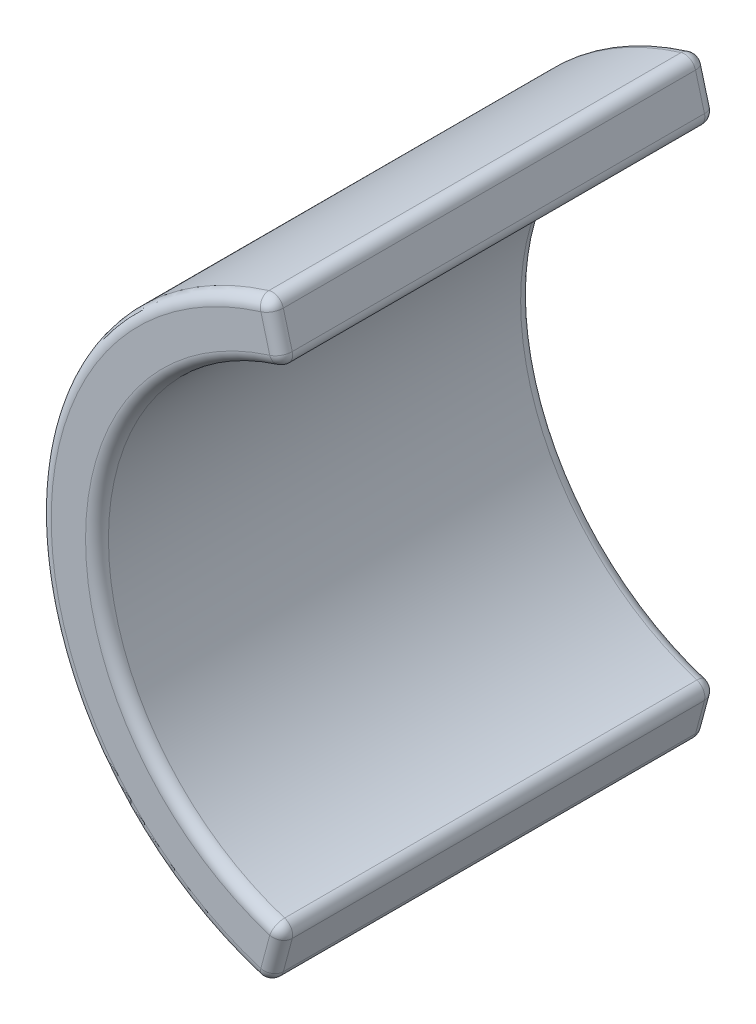
ISO-10303-21;
HEADER;
FILE_DESCRIPTION(('STEP AP214'),'2;1');
FILE_NAME('part.step','',(''),(''),'','','');
FILE_SCHEMA(('AUTOMOTIVE_DESIGN { 1 0 10303 214 1 1 1 1 }'));
ENDSEC;
DATA;
#1=APPLICATION_CONTEXT('core data for automotive mechanical design processes');
#2=APPLICATION_PROTOCOL_DEFINITION('international standard','automotive_design',2000,#1);
#3=PRODUCT_CONTEXT('',#1,'mechanical');
#4=PRODUCT('Part','Part','',(#3));
#5=PRODUCT_RELATED_PRODUCT_CATEGORY('part','',(#4));
#6=PRODUCT_DEFINITION_FORMATION('','',#4);
#7=PRODUCT_DEFINITION_CONTEXT('part definition',#1,'design');
#8=PRODUCT_DEFINITION('design','',#6,#7);
#9=PRODUCT_DEFINITION_SHAPE('','',#8);
#10=(LENGTH_UNIT() NAMED_UNIT(*) SI_UNIT(.MILLI.,.METRE.));
#11=(NAMED_UNIT(*) PLANE_ANGLE_UNIT() SI_UNIT($,.RADIAN.));
#12=(NAMED_UNIT(*) SI_UNIT($,.STERADIAN.) SOLID_ANGLE_UNIT());
#13=UNCERTAINTY_MEASURE_WITH_UNIT(LENGTH_MEASURE(1.E-05),#10,'distance_accuracy_value','');
#14=(GEOMETRIC_REPRESENTATION_CONTEXT(3) GLOBAL_UNCERTAINTY_ASSIGNED_CONTEXT((#13)) GLOBAL_UNIT_ASSIGNED_CONTEXT((#10,
#11,#12)) REPRESENTATION_CONTEXT('',''));
#15=CARTESIAN_POINT('',(0.,0.,0.));
#16=DIRECTION('',(0.,0.,1.));
#17=DIRECTION('',(1.,0.,0.));
#18=AXIS2_PLACEMENT_3D('',#15,#16,#17);
#19=CARTESIAN_POINT('',(0.,0.,0.));
#20=DIRECTION('',(0.,0.,1.));
#21=DIRECTION('',(1.,0.,0.));
#22=AXIS2_PLACEMENT_3D('',#19,#20,#21);
#23=CYLINDRICAL_SURFACE('',#22,13.5);
#24=DIRECTION('',(0.,0.,1.));
#25=VECTOR('',#24,1.);
#26=CARTESIAN_POINT('',(-3.99301020045834,12.8959633040357,0.));
#27=LINE('',#26,#25);
#28=CARTESIAN_POINT('',(-3.99301020045834,12.8959633040357,9.));
#29=VERTEX_POINT('',#28);
#30=CARTESIAN_POINT('',(-3.99301020045834,12.8959633040357,-9.));
#31=VERTEX_POINT('',#30);
#32=EDGE_CURVE('E131',#29,#31,#27,.F.);
#33=ORIENTED_EDGE('',*,*,#32,.T.);
#34=CARTESIAN_POINT('',(0.,0.,-9.));
#35=DIRECTION('',(0.,0.,1.));
#36=DIRECTION('',(1.,0.,0.));
#37=AXIS2_PLACEMENT_3D('',#34,#35,#36);
#38=CIRCLE('',#37,13.5);
#39=CARTESIAN_POINT('',(-3.99301020045834,-12.8959633040357,-9.));
#40=VERTEX_POINT('',#39);
#41=EDGE_CURVE('E127',#31,#40,#38,.T.);
#42=ORIENTED_EDGE('',*,*,#41,.T.);
#43=DIRECTION('',(0.,0.,1.));
#44=VECTOR('',#43,1.);
#45=CARTESIAN_POINT('',(-3.99301020045834,-12.8959633040357,0.));
#46=LINE('',#45,#44);
#47=CARTESIAN_POINT('',(-3.99301020045834,-12.8959633040357,9.));
#48=VERTEX_POINT('',#47);
#49=EDGE_CURVE('E122',#40,#48,#46,.T.);
#50=ORIENTED_EDGE('',*,*,#49,.T.);
#51=CARTESIAN_POINT('',(0.,0.,9.));
#52=DIRECTION('',(0.,0.,-1.));
#53=DIRECTION('',(-1.,0.,0.));
#54=AXIS2_PLACEMENT_3D('',#51,#52,#53);
#55=CIRCLE('',#54,13.5);
#56=EDGE_CURVE('E124',#48,#29,#55,.T.);
#57=ORIENTED_EDGE('',*,*,#56,.T.);
#58=EDGE_LOOP('',(#33,#42,#50,#57));
#59=FACE_BOUND('',#58,.T.);
#60=ADVANCED_FACE('F30',(#59),#23,.T.);
#61=CARTESIAN_POINT('',(-3.49405710888399,13.0399986549024,9.5));
#62=DIRECTION('',(0.,0.,-1.));
#63=DIRECTION('',(-1.,0.,0.));
#64=AXIS2_PLACEMENT_3D('',#61,#62,#63);
#65=PLANE('',#64);
#66=CARTESIAN_POINT('',(0.,0.,9.5));
#67=DIRECTION('',(0.,0.,-1.));
#68=DIRECTION('',(-1.,0.,0.));
#69=AXIS2_PLACEMENT_3D('',#66,#67,#68);
#70=CIRCLE('',#69,13.);
#71=CARTESIAN_POINT('',(-3.8451209337747,12.4183350335159,9.5));
#72=VERTEX_POINT('',#71);
#73=CARTESIAN_POINT('',(-3.8451209337747,-12.4183350335159,9.5));
#74=VERTEX_POINT('',#73);
#75=EDGE_CURVE('E39',#72,#74,#70,.F.);
#76=ORIENTED_EDGE('',*,*,#75,.T.);
#77=DIRECTION('',(0.258819045102518,0.965925826289069,0.));
#78=VECTOR('',#77,1.);
#79=CARTESIAN_POINT('',(2.54297930542262,11.4223796230117,9.5));
#80=LINE('',#79,#78);
#81=CARTESIAN_POINT('',(-3.45656735056167,-10.9682333195019,9.5));
#82=VERTEX_POINT('',#81);
#83=EDGE_CURVE('E11',#74,#82,#80,.T.);
#84=ORIENTED_EDGE('',*,*,#83,.T.);
#85=CARTESIAN_POINT('',(0.,0.,9.5));
#86=DIRECTION('',(0.,0.,-1.));
#87=DIRECTION('',(-1.,0.,0.));
#88=AXIS2_PLACEMENT_3D('',#85,#86,#87);
#89=CIRCLE('',#88,11.5);
#90=CARTESIAN_POINT('',(-3.45656735056167,10.9682333195019,9.5));
#91=VERTEX_POINT('',#90);
#92=EDGE_CURVE('E231',#82,#91,#89,.T.);
#93=ORIENTED_EDGE('',*,*,#92,.T.);
#94=DIRECTION('',(0.258819045102518,-0.965925826289069,0.));
#95=VECTOR('',#94,1.);
#96=CARTESIAN_POINT('',(-3.97702002202853,12.9105891323512,9.5));
#97=LINE('',#96,#95);
#98=EDGE_CURVE('E229',#91,#72,#97,.F.);
#99=ORIENTED_EDGE('',*,*,#98,.T.);
#100=EDGE_LOOP('',(#76,#84,#93,#99));
#101=FACE_BOUND('',#100,.T.);
#102=ADVANCED_FACE('F322',(#101),#65,.F.);
#103=CARTESIAN_POINT('',(0.,0.,0.));
#104=DIRECTION('',(0.,0.,1.));
#105=DIRECTION('',(1.,0.,0.));
#106=AXIS2_PLACEMENT_3D('',#103,#104,#105);
#107=CYLINDRICAL_SURFACE('',#106,11.);
#108=CARTESIAN_POINT('',(0.,0.,-9.));
#109=DIRECTION('',(0.,0.,1.));
#110=DIRECTION('',(1.,0.,0.));
#111=AXIS2_PLACEMENT_3D('',#108,#109,#110);
#112=CIRCLE('',#111,11.);
#113=CARTESIAN_POINT('',(-3.30628181358072,-10.4913536099583,-9.));
#114=VERTEX_POINT('',#113);
#115=CARTESIAN_POINT('',(-3.30628181358072,10.4913536099583,-9.));
#116=VERTEX_POINT('',#115);
#117=EDGE_CURVE('E214',#114,#116,#112,.F.);
#118=ORIENTED_EDGE('',*,*,#117,.T.);
#119=DIRECTION('',(0.,0.,1.));
#120=VECTOR('',#119,1.);
#121=CARTESIAN_POINT('',(-3.30628181358072,10.4913536099583,0.));
#122=LINE('',#121,#120);
#123=CARTESIAN_POINT('',(-3.30628181358072,10.4913536099583,9.));
#124=VERTEX_POINT('',#123);
#125=EDGE_CURVE('E211',#116,#124,#122,.T.);
#126=ORIENTED_EDGE('',*,*,#125,.T.);
#127=CARTESIAN_POINT('',(0.,0.,9.));
#128=DIRECTION('',(0.,0.,-1.));
#129=DIRECTION('',(-1.,0.,0.));
#130=AXIS2_PLACEMENT_3D('',#127,#128,#129);
#131=CIRCLE('',#130,11.);
#132=CARTESIAN_POINT('',(-3.30628181358072,-10.4913536099583,9.));
#133=VERTEX_POINT('',#132);
#134=EDGE_CURVE('E204',#124,#133,#131,.F.);
#135=ORIENTED_EDGE('',*,*,#134,.T.);
#136=DIRECTION('',(0.,0.,1.));
#137=VECTOR('',#136,1.);
#138=CARTESIAN_POINT('',(-3.30628181358072,-10.4913536099583,0.));
#139=LINE('',#138,#137);
#140=EDGE_CURVE('E207',#133,#114,#139,.F.);
#141=ORIENTED_EDGE('',*,*,#140,.T.);
#142=EDGE_LOOP('',(#118,#126,#135,#141));
#143=FACE_BOUND('',#142,.T.);
#144=ADVANCED_FACE('F212',(#143),#107,.F.);
#145=CARTESIAN_POINT('',(-3.49405710888399,13.0399986549024,-9.5));
#146=DIRECTION('',(0.,0.,1.));
#147=DIRECTION('',(1.,0.,0.));
#148=AXIS2_PLACEMENT_3D('',#145,#146,#147);
#149=PLANE('',#148);
#150=CARTESIAN_POINT('',(0.,0.,-9.5));
#151=DIRECTION('',(0.,0.,1.));
#152=DIRECTION('',(1.,0.,0.));
#153=AXIS2_PLACEMENT_3D('',#150,#151,#152);
#154=CIRCLE('',#153,11.5);
#155=CARTESIAN_POINT('',(-3.45656735056167,10.9682333195019,-9.5));
#156=VERTEX_POINT('',#155);
#157=CARTESIAN_POINT('',(-3.45656735056167,-10.9682333195019,-9.5));
#158=VERTEX_POINT('',#157);
#159=EDGE_CURVE('E259',#156,#158,#154,.T.);
#160=ORIENTED_EDGE('',*,*,#159,.T.);
#161=DIRECTION('',(-0.258819045102518,-0.965925826289069,0.));
#162=VECTOR('',#161,1.);
#163=CARTESIAN_POINT('',(2.54297930542262,11.4223796230117,-9.5));
#164=LINE('',#163,#162);
#165=CARTESIAN_POINT('',(-3.8451209337747,-12.4183350335159,-9.5));
#166=VERTEX_POINT('',#165);
#167=EDGE_CURVE('E265',#158,#166,#164,.T.);
#168=ORIENTED_EDGE('',*,*,#167,.T.);
#169=CARTESIAN_POINT('',(0.,0.,-9.5));
#170=DIRECTION('',(0.,0.,1.));
#171=DIRECTION('',(1.,0.,0.));
#172=AXIS2_PLACEMENT_3D('',#169,#170,#171);
#173=CIRCLE('',#172,13.);
#174=CARTESIAN_POINT('',(-3.8451209337747,12.4183350335159,-9.5));
#175=VERTEX_POINT('',#174);
#176=EDGE_CURVE('E262',#166,#175,#173,.F.);
#177=ORIENTED_EDGE('',*,*,#176,.T.);
#178=DIRECTION('',(-0.258819045102518,0.965925826289069,0.));
#179=VECTOR('',#178,1.);
#180=CARTESIAN_POINT('',(-3.32997240927223,10.4957745666285,-9.5));
#181=LINE('',#180,#179);
#182=EDGE_CURVE('E253',#175,#156,#181,.F.);
#183=ORIENTED_EDGE('',*,*,#182,.T.);
#184=EDGE_LOOP('',(#160,#168,#177,#183));
#185=FACE_BOUND('',#184,.T.);
#186=ADVANCED_FACE('F263',(#185),#149,.F.);
#187=CARTESIAN_POINT('',(-3.49405710888399,13.0399986549024,9.5));
#188=DIRECTION('',(0.965925826289069,0.258819045102518,0.));
#189=DIRECTION('',(0.,0.,1.));
#190=AXIS2_PLACEMENT_3D('',#187,#188,#189);
#191=PLANE('',#190);
#192=DIRECTION('',(0.,0.,-1.));
#193=VECTOR('',#192,1.);
#194=CARTESIAN_POINT('',(-2.97360443741713,11.0976428420531,-9.5));
#195=LINE('',#194,#193);
#196=CARTESIAN_POINT('',(-2.97360443741713,11.0976428420531,9.));
#197=VERTEX_POINT('',#196);
#198=CARTESIAN_POINT('',(-2.97360443741713,11.0976428420531,-9.));
#199=VERTEX_POINT('',#198);
#200=EDGE_CURVE('E277',#197,#199,#195,.T.);
#201=ORIENTED_EDGE('',*,*,#200,.T.);
#202=DIRECTION('',(-0.258819045102518,0.965925826289069,0.));
#203=VECTOR('',#202,1.);
#204=CARTESIAN_POINT('',(-3.49405710888399,13.0399986549024,-9.));
#205=LINE('',#204,#203);
#206=CARTESIAN_POINT('',(-3.36215802063016,12.5477445560671,-9.));
#207=VERTEX_POINT('',#206);
#208=EDGE_CURVE('E208',#199,#207,#205,.T.);
#209=ORIENTED_EDGE('',*,*,#208,.T.);
#210=DIRECTION('',(0.,0.,-1.));
#211=VECTOR('',#210,1.);
#212=CARTESIAN_POINT('',(-3.36215802063016,12.5477445560671,9.5));
#213=LINE('',#212,#211);
#214=CARTESIAN_POINT('',(-3.36215802063016,12.5477445560671,9.));
#215=VERTEX_POINT('',#214);
#216=EDGE_CURVE('E275',#207,#215,#213,.F.);
#217=ORIENTED_EDGE('',*,*,#216,.T.);
#218=DIRECTION('',(0.258819045102518,-0.965925826289069,0.));
#219=VECTOR('',#218,1.);
#220=CARTESIAN_POINT('',(-2.8470094961277,10.6251840891798,9.));
#221=LINE('',#220,#219);
#222=EDGE_CURVE('E270',#215,#197,#221,.T.);
#223=ORIENTED_EDGE('',*,*,#222,.T.);
#224=EDGE_LOOP('',(#201,#209,#217,#223));
#225=FACE_BOUND('',#224,.T.);
#226=ADVANCED_FACE('F305',(#225),#191,.T.);
#227=CARTESIAN_POINT('',(-3.49405710888399,-13.0399986549024,9.5));
#228=DIRECTION('',(-0.965925826289069,0.258819045102518,0.));
#229=DIRECTION('',(0.,0.,1.));
#230=AXIS2_PLACEMENT_3D('',#227,#228,#229);
#231=PLANE('',#230);
#232=DIRECTION('',(0.,0.,1.));
#233=VECTOR('',#232,1.);
#234=CARTESIAN_POINT('',(-3.36215802063016,-12.5477445560671,9.5));
#235=LINE('',#234,#233);
#236=CARTESIAN_POINT('',(-3.36215802063016,-12.5477445560671,9.));
#237=VERTEX_POINT('',#236);
#238=CARTESIAN_POINT('',(-3.36215802063016,-12.5477445560671,-9.));
#239=VERTEX_POINT('',#238);
#240=EDGE_CURVE('E147',#237,#239,#235,.F.);
#241=ORIENTED_EDGE('',*,*,#240,.T.);
#242=DIRECTION('',(-0.258819045102518,-0.965925826289069,0.));
#243=VECTOR('',#242,1.);
#244=CARTESIAN_POINT('',(-3.49405710888399,-13.0399986549024,-9.));
#245=LINE('',#244,#243);
#246=CARTESIAN_POINT('',(-2.97360443741713,-11.0976428420531,-9.));
#247=VERTEX_POINT('',#246);
#248=EDGE_CURVE('E227',#239,#247,#245,.F.);
#249=ORIENTED_EDGE('',*,*,#248,.T.);
#250=DIRECTION('',(0.,0.,1.));
#251=VECTOR('',#250,1.);
#252=CARTESIAN_POINT('',(-2.97360443741713,-11.0976428420531,9.5));
#253=LINE('',#252,#251);
#254=CARTESIAN_POINT('',(-2.97360443741713,-11.0976428420531,9.));
#255=VERTEX_POINT('',#254);
#256=EDGE_CURVE('E220',#247,#255,#253,.T.);
#257=ORIENTED_EDGE('',*,*,#256,.T.);
#258=DIRECTION('',(0.258819045102518,0.965925826289069,0.));
#259=VECTOR('',#258,1.);
#260=CARTESIAN_POINT('',(-3.49405710888399,-13.0399986549024,9.));
#261=LINE('',#260,#259);
#262=EDGE_CURVE('E218',#255,#237,#261,.F.);
#263=ORIENTED_EDGE('',*,*,#262,.T.);
#264=EDGE_LOOP('',(#241,#249,#257,#263));
#265=FACE_BOUND('',#264,.T.);
#266=ADVANCED_FACE('F333',(#265),#231,.F.);
#267=CARTESIAN_POINT('',(0.,0.,9.));
#268=DIRECTION('',(0.,0.,-1.));
#269=DIRECTION('',(-1.,0.,0.));
#270=AXIS2_PLACEMENT_3D('',#267,#268,#269);
#271=TOROIDAL_SURFACE('',#270,11.5,0.5);
#272=CARTESIAN_POINT('',(-3.45656735056167,10.9682333195019,9.));
#273=DIRECTION('',(0.95375941908712,0.300571073961883,0.));
#274=DIRECTION('',(-0.300571073961883,0.95375941908712,0.));
#275=AXIS2_PLACEMENT_3D('',#272,#273,#274);
#276=CIRCLE('',#275,0.5);
#277=EDGE_CURVE('E34',#91,#124,#276,.T.);
#278=ORIENTED_EDGE('',*,*,#277,.F.);
#279=ORIENTED_EDGE('',*,*,#92,.F.);
#280=CARTESIAN_POINT('',(-3.45656735056167,-10.9682333195019,9.));
#281=DIRECTION('',(0.95375941908712,-0.300571073961883,0.));
#282=DIRECTION('',(0.300571073961883,0.95375941908712,0.));
#283=AXIS2_PLACEMENT_3D('',#280,#281,#282);
#284=CIRCLE('',#283,0.5);
#285=EDGE_CURVE('E188',#133,#82,#284,.T.);
#286=ORIENTED_EDGE('',*,*,#285,.F.);
#287=ORIENTED_EDGE('',*,*,#134,.F.);
#288=EDGE_LOOP('',(#278,#279,#286,#287));
#289=FACE_BOUND('',#288,.T.);
#290=ADVANCED_FACE('F32',(#289),#271,.T.);
#291=CARTESIAN_POINT('',(-3.45656735056167,10.9682333195019,9.));
#292=DIRECTION('',(0.,0.,1.));
#293=DIRECTION('',(1.,0.,0.));
#294=AXIS2_PLACEMENT_3D('',#291,#292,#293);
#295=SPHERICAL_SURFACE('',#294,0.5);
#296=CARTESIAN_POINT('',(-3.45656735056167,10.9682333195019,9.));
#297=DIRECTION('',(0.258819045102519,-0.965925826289069,0.));
#298=DIRECTION('',(0.965925826289069,0.258819045102519,0.));
#299=AXIS2_PLACEMENT_3D('',#296,#297,#298);
#300=CIRCLE('',#299,0.5);
#301=EDGE_CURVE('E184',#91,#197,#300,.F.);
#302=ORIENTED_EDGE('',*,*,#301,.F.);
#303=ORIENTED_EDGE('',*,*,#277,.T.);
#304=CARTESIAN_POINT('',(-3.45656735056167,10.9682333195019,9.));
#305=DIRECTION('',(0.,0.,1.));
#306=DIRECTION('',(1.,0.,0.));
#307=AXIS2_PLACEMENT_3D('',#304,#305,#306);
#308=CIRCLE('',#307,0.5);
#309=EDGE_CURVE('E187',#197,#124,#308,.F.);
#310=ORIENTED_EDGE('',*,*,#309,.F.);
#311=EDGE_LOOP('',(#302,#303,#310));
#312=FACE_BOUND('',#311,.T.);
#313=ADVANCED_FACE('F200',(#312),#295,.T.);
#314=CARTESIAN_POINT('',(-3.45656735056167,-10.9682333195019,9.));
#315=DIRECTION('',(0.,0.,1.));
#316=DIRECTION('',(1.,0.,0.));
#317=AXIS2_PLACEMENT_3D('',#314,#315,#316);
#318=SPHERICAL_SURFACE('',#317,0.5);
#319=CARTESIAN_POINT('',(-3.45656735056167,-10.9682333195019,9.));
#320=DIRECTION('',(0.,0.,1.));
#321=DIRECTION('',(1.,0.,0.));
#322=AXIS2_PLACEMENT_3D('',#319,#320,#321);
#323=CIRCLE('',#322,0.5);
#324=EDGE_CURVE('E178',#133,#255,#323,.F.);
#325=ORIENTED_EDGE('',*,*,#324,.F.);
#326=ORIENTED_EDGE('',*,*,#285,.T.);
#327=CARTESIAN_POINT('',(-3.45656735056167,-10.9682333195019,9.));
#328=DIRECTION('',(0.258819045102516,0.96592582628907,0.));
#329=DIRECTION('',(-0.96592582628907,0.258819045102516,0.));
#330=AXIS2_PLACEMENT_3D('',#327,#328,#329);
#331=CIRCLE('',#330,0.5);
#332=EDGE_CURVE('E181',#255,#82,#331,.F.);
#333=ORIENTED_EDGE('',*,*,#332,.F.);
#334=EDGE_LOOP('',(#325,#326,#333));
#335=FACE_BOUND('',#334,.T.);
#336=ADVANCED_FACE('F458',(#335),#318,.T.);
#337=CARTESIAN_POINT('',(-3.45656735056167,10.9682333195019,0.));
#338=DIRECTION('',(0.,0.,1.));
#339=DIRECTION('',(1.,0.,0.));
#340=AXIS2_PLACEMENT_3D('',#337,#338,#339);
#341=CYLINDRICAL_SURFACE('',#340,0.5);
#342=ORIENTED_EDGE('',*,*,#309,.T.);
#343=ORIENTED_EDGE('',*,*,#125,.F.);
#344=CARTESIAN_POINT('',(-3.45656735056167,10.9682333195019,-9.));
#345=DIRECTION('',(0.,0.,-1.));
#346=DIRECTION('',(-1.,0.,0.));
#347=AXIS2_PLACEMENT_3D('',#344,#345,#346);
#348=CIRCLE('',#347,0.5);
#349=EDGE_CURVE('E172',#199,#116,#348,.T.);
#350=ORIENTED_EDGE('',*,*,#349,.F.);
#351=ORIENTED_EDGE('',*,*,#200,.F.);
#352=EDGE_LOOP('',(#342,#343,#350,#351));
#353=FACE_BOUND('',#352,.T.);
#354=ADVANCED_FACE('F450',(#353),#341,.T.);
#355=CARTESIAN_POINT('',(-3.97702002202853,12.9105891323512,9.));
#356=DIRECTION('',(-0.258819045102518,0.965925826289069,0.));
#357=DIRECTION('',(-0.965925826289069,-0.258819045102518,0.));
#358=AXIS2_PLACEMENT_3D('',#355,#356,#357);
#359=CYLINDRICAL_SURFACE('',#358,0.5);
#360=ORIENTED_EDGE('',*,*,#301,.T.);
#361=ORIENTED_EDGE('',*,*,#222,.F.);
#362=CARTESIAN_POINT('',(-3.8451209337747,12.4183350335159,9.));
#363=DIRECTION('',(-0.258819045102519,0.965925826289069,0.));
#364=DIRECTION('',(-0.965925826289069,-0.258819045102519,0.));
#365=AXIS2_PLACEMENT_3D('',#362,#363,#364);
#366=CIRCLE('',#365,0.5);
#367=EDGE_CURVE('E169',#72,#215,#366,.T.);
#368=ORIENTED_EDGE('',*,*,#367,.F.);
#369=ORIENTED_EDGE('',*,*,#98,.F.);
#370=EDGE_LOOP('',(#360,#361,#368,#369));
#371=FACE_BOUND('',#370,.T.);
#372=ADVANCED_FACE('F308',(#371),#359,.T.);
#373=CARTESIAN_POINT('',(0.,0.,9.));
#374=DIRECTION('',(0.,0.,-1.));
#375=DIRECTION('',(-1.,0.,0.));
#376=AXIS2_PLACEMENT_3D('',#373,#374,#375);
#377=TOROIDAL_SURFACE('',#376,13.,0.5);
#378=CARTESIAN_POINT('',(-3.8451209337747,-12.4183350335159,9.));
#379=DIRECTION('',(0.955256541039682,-0.295778533367284,0.));
#380=DIRECTION('',(0.295778533367284,0.955256541039682,0.));
#381=AXIS2_PLACEMENT_3D('',#378,#379,#380);
#382=CIRCLE('',#381,0.5);
#383=EDGE_CURVE('E136',#74,#48,#382,.T.);
#384=ORIENTED_EDGE('',*,*,#383,.F.);
#385=ORIENTED_EDGE('',*,*,#75,.F.);
#386=CARTESIAN_POINT('',(-3.8451209337747,12.4183350335159,9.));
#387=DIRECTION('',(0.955256541039682,0.295778533367284,0.));
#388=DIRECTION('',(-0.295778533367284,0.955256541039682,0.));
#389=AXIS2_PLACEMENT_3D('',#386,#387,#388);
#390=CIRCLE('',#389,0.5);
#391=EDGE_CURVE('E138',#29,#72,#390,.T.);
#392=ORIENTED_EDGE('',*,*,#391,.F.);
#393=ORIENTED_EDGE('',*,*,#56,.F.);
#394=EDGE_LOOP('',(#384,#385,#392,#393));
#395=FACE_BOUND('',#394,.T.);
#396=ADVANCED_FACE('F134',(#395),#377,.T.);
#397=CARTESIAN_POINT('',(2.54297930542262,11.4223796230117,9.));
#398=DIRECTION('',(0.258819045102518,0.965925826289069,0.));
#399=DIRECTION('',(-0.965925826289069,0.258819045102518,0.));
#400=AXIS2_PLACEMENT_3D('',#397,#398,#399);
#401=CYLINDRICAL_SURFACE('',#400,0.5);
#402=ORIENTED_EDGE('',*,*,#332,.T.);
#403=ORIENTED_EDGE('',*,*,#83,.F.);
#404=CARTESIAN_POINT('',(-3.8451209337747,-12.4183350335159,9.));
#405=DIRECTION('',(-0.258819045102519,-0.965925826289069,0.));
#406=DIRECTION('',(0.965925826289069,-0.258819045102519,0.));
#407=AXIS2_PLACEMENT_3D('',#404,#405,#406);
#408=CIRCLE('',#407,0.5);
#409=EDGE_CURVE('E47',#237,#74,#408,.T.);
#410=ORIENTED_EDGE('',*,*,#409,.F.);
#411=ORIENTED_EDGE('',*,*,#262,.F.);
#412=EDGE_LOOP('',(#402,#403,#410,#411));
#413=FACE_BOUND('',#412,.T.);
#414=ADVANCED_FACE('F427',(#413),#401,.T.);
#415=CARTESIAN_POINT('',(-3.45656735056167,-10.9682333195019,0.));
#416=DIRECTION('',(0.,0.,1.));
#417=DIRECTION('',(1.,0.,0.));
#418=AXIS2_PLACEMENT_3D('',#415,#416,#417);
#419=CYLINDRICAL_SURFACE('',#418,0.5);
#420=ORIENTED_EDGE('',*,*,#324,.T.);
#421=ORIENTED_EDGE('',*,*,#256,.F.);
#422=CARTESIAN_POINT('',(-3.45656735056167,-10.9682333195019,-9.));
#423=DIRECTION('',(0.,0.,-1.));
#424=DIRECTION('',(-1.,0.,0.));
#425=AXIS2_PLACEMENT_3D('',#422,#423,#424);
#426=CIRCLE('',#425,0.5);
#427=EDGE_CURVE('E164',#114,#247,#426,.T.);
#428=ORIENTED_EDGE('',*,*,#427,.F.);
#429=ORIENTED_EDGE('',*,*,#140,.F.);
#430=EDGE_LOOP('',(#420,#421,#428,#429));
#431=FACE_BOUND('',#430,.T.);
#432=ADVANCED_FACE('F288',(#431),#419,.T.);
#433=CARTESIAN_POINT('',(0.,0.,-9.));
#434=DIRECTION('',(0.,0.,1.));
#435=DIRECTION('',(1.,0.,0.));
#436=AXIS2_PLACEMENT_3D('',#433,#434,#435);
#437=TOROIDAL_SURFACE('',#436,11.5,0.5);
#438=CARTESIAN_POINT('',(-3.45656735056167,10.9682333195019,-9.));
#439=DIRECTION('',(0.95375941908712,0.300571073961883,0.));
#440=DIRECTION('',(-0.300571073961883,0.95375941908712,0.));
#441=AXIS2_PLACEMENT_3D('',#438,#439,#440);
#442=CIRCLE('',#441,0.5);
#443=EDGE_CURVE('E175',#116,#156,#442,.T.);
#444=ORIENTED_EDGE('',*,*,#443,.F.);
#445=ORIENTED_EDGE('',*,*,#117,.F.);
#446=CARTESIAN_POINT('',(-3.45656735056167,-10.9682333195019,-9.));
#447=DIRECTION('',(0.95375941908712,-0.300571073961882,0.));
#448=DIRECTION('',(0.300571073961882,0.95375941908712,0.));
#449=AXIS2_PLACEMENT_3D('',#446,#447,#448);
#450=CIRCLE('',#449,0.5);
#451=EDGE_CURVE('E161',#158,#114,#450,.T.);
#452=ORIENTED_EDGE('',*,*,#451,.F.);
#453=ORIENTED_EDGE('',*,*,#159,.F.);
#454=EDGE_LOOP('',(#444,#445,#452,#453));
#455=FACE_BOUND('',#454,.T.);
#456=ADVANCED_FACE('F285',(#455),#437,.T.);
#457=CARTESIAN_POINT('',(-3.45656735056167,10.9682333195019,-9.));
#458=DIRECTION('',(0.,0.,1.));
#459=DIRECTION('',(1.,0.,0.));
#460=AXIS2_PLACEMENT_3D('',#457,#458,#459);
#461=SPHERICAL_SURFACE('',#460,0.5);
#462=ORIENTED_EDGE('',*,*,#349,.T.);
#463=ORIENTED_EDGE('',*,*,#443,.T.);
#464=CARTESIAN_POINT('',(-3.45656735056167,10.9682333195019,-9.));
#465=DIRECTION('',(0.258819045102519,-0.965925826289069,0.));
#466=DIRECTION('',(0.965925826289069,0.258819045102519,0.));
#467=AXIS2_PLACEMENT_3D('',#464,#465,#466);
#468=CIRCLE('',#467,0.5);
#469=EDGE_CURVE('E152',#199,#156,#468,.F.);
#470=ORIENTED_EDGE('',*,*,#469,.F.);
#471=EDGE_LOOP('',(#462,#463,#470));
#472=FACE_BOUND('',#471,.T.);
#473=ADVANCED_FACE('F312',(#472),#461,.T.);
#474=CARTESIAN_POINT('',(-3.8451209337747,12.4183350335159,9.));
#475=DIRECTION('',(0.,0.,1.));
#476=DIRECTION('',(1.,0.,0.));
#477=AXIS2_PLACEMENT_3D('',#474,#475,#476);
#478=SPHERICAL_SURFACE('',#477,0.5);
#479=ORIENTED_EDGE('',*,*,#391,.T.);
#480=ORIENTED_EDGE('',*,*,#367,.T.);
#481=CARTESIAN_POINT('',(-3.8451209337747,12.4183350335159,9.));
#482=DIRECTION('',(0.,0.,1.));
#483=DIRECTION('',(1.,0.,0.));
#484=AXIS2_PLACEMENT_3D('',#481,#482,#483);
#485=CIRCLE('',#484,0.5);
#486=EDGE_CURVE('E148',#29,#215,#485,.F.);
#487=ORIENTED_EDGE('',*,*,#486,.F.);
#488=EDGE_LOOP('',(#479,#480,#487));
#489=FACE_BOUND('',#488,.T.);
#490=ADVANCED_FACE('F310',(#489),#478,.T.);
#491=CARTESIAN_POINT('',(-3.8451209337747,-12.4183350335159,9.));
#492=DIRECTION('',(0.,0.,1.));
#493=DIRECTION('',(1.,0.,0.));
#494=AXIS2_PLACEMENT_3D('',#491,#492,#493);
#495=SPHERICAL_SURFACE('',#494,0.5);
#496=ORIENTED_EDGE('',*,*,#409,.T.);
#497=ORIENTED_EDGE('',*,*,#383,.T.);
#498=CARTESIAN_POINT('',(-3.8451209337747,-12.4183350335159,9.));
#499=DIRECTION('',(0.,0.,1.));
#500=DIRECTION('',(1.,0.,0.));
#501=AXIS2_PLACEMENT_3D('',#498,#499,#500);
#502=CIRCLE('',#501,0.5);
#503=EDGE_CURVE('E142',#237,#48,#502,.F.);
#504=ORIENTED_EDGE('',*,*,#503,.F.);
#505=EDGE_LOOP('',(#496,#497,#504));
#506=FACE_BOUND('',#505,.T.);
#507=ADVANCED_FACE('F141',(#506),#495,.T.);
#508=CARTESIAN_POINT('',(-3.45656735056167,-10.9682333195019,-9.));
#509=DIRECTION('',(0.,0.,1.));
#510=DIRECTION('',(1.,0.,0.));
#511=AXIS2_PLACEMENT_3D('',#508,#509,#510);
#512=SPHERICAL_SURFACE('',#511,0.5);
#513=ORIENTED_EDGE('',*,*,#451,.T.);
#514=ORIENTED_EDGE('',*,*,#427,.T.);
#515=CARTESIAN_POINT('',(-3.45656735056167,-10.9682333195019,-9.));
#516=DIRECTION('',(0.258819045102519,0.965925826289069,0.));
#517=DIRECTION('',(-0.965925826289069,0.258819045102519,0.));
#518=AXIS2_PLACEMENT_3D('',#515,#516,#517);
#519=CIRCLE('',#518,0.5);
#520=EDGE_CURVE('E149',#158,#247,#519,.F.);
#521=ORIENTED_EDGE('',*,*,#520,.F.);
#522=EDGE_LOOP('',(#513,#514,#521));
#523=FACE_BOUND('',#522,.T.);
#524=ADVANCED_FACE('F290',(#523),#512,.T.);
#525=CARTESIAN_POINT('',(-3.97702002202853,12.9105891323512,-9.));
#526=DIRECTION('',(0.258819045102518,-0.965925826289069,0.));
#527=DIRECTION('',(0.965925826289069,0.258819045102518,0.));
#528=AXIS2_PLACEMENT_3D('',#525,#526,#527);
#529=CYLINDRICAL_SURFACE('',#528,0.5);
#530=ORIENTED_EDGE('',*,*,#469,.T.);
#531=ORIENTED_EDGE('',*,*,#182,.F.);
#532=CARTESIAN_POINT('',(-3.8451209337747,12.4183350335159,-9.));
#533=DIRECTION('',(-0.258819045102519,0.965925826289069,0.));
#534=DIRECTION('',(-0.965925826289069,-0.258819045102519,0.));
#535=AXIS2_PLACEMENT_3D('',#532,#533,#534);
#536=CIRCLE('',#535,0.5);
#537=EDGE_CURVE('E155',#207,#175,#536,.T.);
#538=ORIENTED_EDGE('',*,*,#537,.F.);
#539=ORIENTED_EDGE('',*,*,#208,.F.);
#540=EDGE_LOOP('',(#530,#531,#538,#539));
#541=FACE_BOUND('',#540,.T.);
#542=ADVANCED_FACE('F255',(#541),#529,.T.);
#543=CARTESIAN_POINT('',(-3.8451209337747,12.4183350335159,0.));
#544=DIRECTION('',(0.,0.,1.));
#545=DIRECTION('',(1.,0.,0.));
#546=AXIS2_PLACEMENT_3D('',#543,#544,#545);
#547=CYLINDRICAL_SURFACE('',#546,0.5);
#548=ORIENTED_EDGE('',*,*,#486,.T.);
#549=ORIENTED_EDGE('',*,*,#216,.F.);
#550=CARTESIAN_POINT('',(-3.8451209337747,12.4183350335159,-9.));
#551=DIRECTION('',(0.,0.,-1.));
#552=DIRECTION('',(-1.,0.,0.));
#553=AXIS2_PLACEMENT_3D('',#550,#551,#552);
#554=CIRCLE('',#553,0.5);
#555=EDGE_CURVE('E243',#31,#207,#554,.T.);
#556=ORIENTED_EDGE('',*,*,#555,.F.);
#557=ORIENTED_EDGE('',*,*,#32,.F.);
#558=EDGE_LOOP('',(#548,#549,#556,#557));
#559=FACE_BOUND('',#558,.T.);
#560=ADVANCED_FACE('F302',(#559),#547,.T.);
#561=CARTESIAN_POINT('',(-3.8451209337747,-12.4183350335159,0.));
#562=DIRECTION('',(0.,0.,1.));
#563=DIRECTION('',(1.,0.,0.));
#564=AXIS2_PLACEMENT_3D('',#561,#562,#563);
#565=CYLINDRICAL_SURFACE('',#564,0.5);
#566=ORIENTED_EDGE('',*,*,#503,.T.);
#567=ORIENTED_EDGE('',*,*,#49,.F.);
#568=CARTESIAN_POINT('',(-3.8451209337747,-12.4183350335159,-9.));
#569=DIRECTION('',(0.,0.,-1.));
#570=DIRECTION('',(-1.,0.,0.));
#571=AXIS2_PLACEMENT_3D('',#568,#569,#570);
#572=CIRCLE('',#571,0.5);
#573=EDGE_CURVE('E240',#239,#40,#572,.T.);
#574=ORIENTED_EDGE('',*,*,#573,.F.);
#575=ORIENTED_EDGE('',*,*,#240,.F.);
#576=EDGE_LOOP('',(#566,#567,#574,#575));
#577=FACE_BOUND('',#576,.T.);
#578=ADVANCED_FACE('F145',(#577),#565,.T.);
#579=CARTESIAN_POINT('',(2.54297930542262,11.4223796230117,-9.));
#580=DIRECTION('',(-0.258819045102518,-0.965925826289069,0.));
#581=DIRECTION('',(0.965925826289069,-0.258819045102518,0.));
#582=AXIS2_PLACEMENT_3D('',#579,#580,#581);
#583=CYLINDRICAL_SURFACE('',#582,0.5);
#584=ORIENTED_EDGE('',*,*,#520,.T.);
#585=ORIENTED_EDGE('',*,*,#248,.F.);
#586=CARTESIAN_POINT('',(-3.8451209337747,-12.4183350335159,-9.));
#587=DIRECTION('',(-0.258819045102516,-0.96592582628907,0.));
#588=DIRECTION('',(0.96592582628907,-0.258819045102516,0.));
#589=AXIS2_PLACEMENT_3D('',#586,#587,#588);
#590=CIRCLE('',#589,0.5);
#591=EDGE_CURVE('E238',#166,#239,#590,.T.);
#592=ORIENTED_EDGE('',*,*,#591,.F.);
#593=ORIENTED_EDGE('',*,*,#167,.F.);
#594=EDGE_LOOP('',(#584,#585,#592,#593));
#595=FACE_BOUND('',#594,.T.);
#596=ADVANCED_FACE('F293',(#595),#583,.T.);
#597=CARTESIAN_POINT('',(-3.8451209337747,12.4183350335159,-9.));
#598=DIRECTION('',(0.,0.,1.));
#599=DIRECTION('',(1.,0.,0.));
#600=AXIS2_PLACEMENT_3D('',#597,#598,#599);
#601=SPHERICAL_SURFACE('',#600,0.5);
#602=ORIENTED_EDGE('',*,*,#555,.T.);
#603=ORIENTED_EDGE('',*,*,#537,.T.);
#604=CARTESIAN_POINT('',(-3.8451209337747,12.4183350335159,-9.));
#605=DIRECTION('',(0.955256541039682,0.295778533367286,0.));
#606=DIRECTION('',(-0.295778533367286,0.955256541039682,0.));
#607=AXIS2_PLACEMENT_3D('',#604,#605,#606);
#608=CIRCLE('',#607,0.5);
#609=EDGE_CURVE('E236',#31,#175,#608,.F.);
#610=ORIENTED_EDGE('',*,*,#609,.F.);
#611=EDGE_LOOP('',(#602,#603,#610));
#612=FACE_BOUND('',#611,.T.);
#613=ADVANCED_FACE('F250',(#612),#601,.T.);
#614=CARTESIAN_POINT('',(-3.8451209337747,-12.4183350335159,-9.));
#615=DIRECTION('',(0.,0.,1.));
#616=DIRECTION('',(1.,0.,0.));
#617=AXIS2_PLACEMENT_3D('',#614,#615,#616);
#618=SPHERICAL_SURFACE('',#617,0.5);
#619=ORIENTED_EDGE('',*,*,#591,.T.);
#620=ORIENTED_EDGE('',*,*,#573,.T.);
#621=CARTESIAN_POINT('',(-3.8451209337747,-12.4183350335159,-9.));
#622=DIRECTION('',(0.955256541039682,-0.295778533367284,0.));
#623=DIRECTION('',(0.295778533367284,0.955256541039682,0.));
#624=AXIS2_PLACEMENT_3D('',#621,#622,#623);
#625=CIRCLE('',#624,0.5);
#626=EDGE_CURVE('E234',#166,#40,#625,.F.);
#627=ORIENTED_EDGE('',*,*,#626,.F.);
#628=EDGE_LOOP('',(#619,#620,#627));
#629=FACE_BOUND('',#628,.T.);
#630=ADVANCED_FACE('F295',(#629),#618,.T.);
#631=CARTESIAN_POINT('',(0.,0.,-9.));
#632=DIRECTION('',(0.,0.,1.));
#633=DIRECTION('',(1.,0.,0.));
#634=AXIS2_PLACEMENT_3D('',#631,#632,#633);
#635=TOROIDAL_SURFACE('',#634,13.,0.5);
#636=ORIENTED_EDGE('',*,*,#609,.T.);
#637=ORIENTED_EDGE('',*,*,#176,.F.);
#638=ORIENTED_EDGE('',*,*,#626,.T.);
#639=ORIENTED_EDGE('',*,*,#41,.F.);
#640=EDGE_LOOP('',(#636,#637,#638,#639));
#641=FACE_BOUND('',#640,.T.);
#642=ADVANCED_FACE('F296',(#641),#635,.T.);
#643=CLOSED_SHELL('',(#60,#102,#144,#186,#226,#266,#290,#313,#336,#354,#372,#396,#414,#432,#456,
#473,#490,#507,#524,#542,#560,#578,#596,#613,#630,#642));
#644=MANIFOLD_SOLID_BREP('B2',#643);
#645=ADVANCED_BREP_SHAPE_REPRESENTATION('',(#18,#644),#14);
#646=SHAPE_DEFINITION_REPRESENTATION(#9,#645);
ENDSEC;
END-ISO-10303-21;
